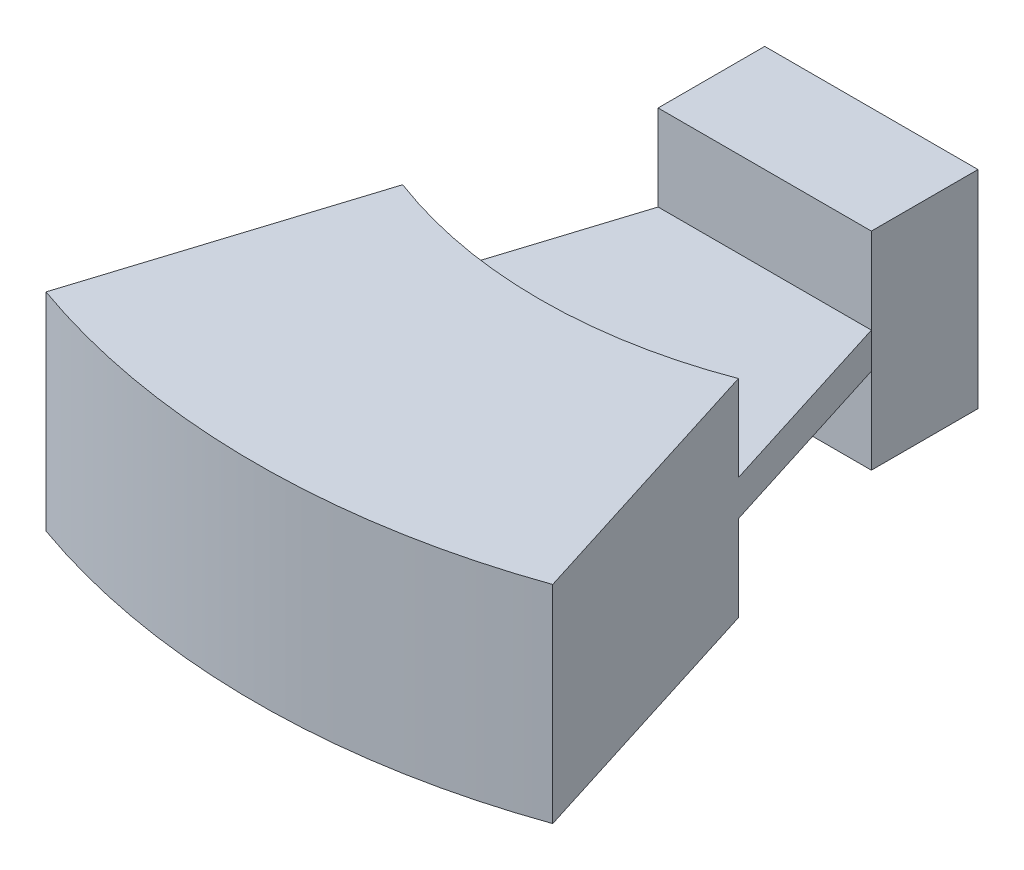
ISO-10303-21;
HEADER;
FILE_DESCRIPTION(('STEP AP214'),'2;1');
FILE_NAME('part.step','',(''),(''),'','','');
FILE_SCHEMA(('AUTOMOTIVE_DESIGN { 1 0 10303 214 1 1 1 1 }'));
ENDSEC;
DATA;
#1=APPLICATION_CONTEXT('core data for automotive mechanical design processes');
#2=APPLICATION_PROTOCOL_DEFINITION('international standard','automotive_design',2000,#1);
#3=PRODUCT_CONTEXT('',#1,'mechanical');
#4=PRODUCT('Part','Part','',(#3));
#5=PRODUCT_RELATED_PRODUCT_CATEGORY('part','',(#4));
#6=PRODUCT_DEFINITION_FORMATION('','',#4);
#7=PRODUCT_DEFINITION_CONTEXT('part definition',#1,'design');
#8=PRODUCT_DEFINITION('design','',#6,#7);
#9=PRODUCT_DEFINITION_SHAPE('','',#8);
#10=(LENGTH_UNIT() NAMED_UNIT(*) SI_UNIT(.MILLI.,.METRE.));
#11=(NAMED_UNIT(*) PLANE_ANGLE_UNIT() SI_UNIT($,.RADIAN.));
#12=(NAMED_UNIT(*) SI_UNIT($,.STERADIAN.) SOLID_ANGLE_UNIT());
#13=UNCERTAINTY_MEASURE_WITH_UNIT(LENGTH_MEASURE(1.E-05),#10,'distance_accuracy_value','');
#14=(GEOMETRIC_REPRESENTATION_CONTEXT(3) GLOBAL_UNCERTAINTY_ASSIGNED_CONTEXT((#13)) GLOBAL_UNIT_ASSIGNED_CONTEXT((#10,
#11,#12)) REPRESENTATION_CONTEXT('',''));
#15=CARTESIAN_POINT('',(0.,0.,0.));
#16=DIRECTION('',(0.,0.,1.));
#17=DIRECTION('',(1.,0.,0.));
#18=AXIS2_PLACEMENT_3D('',#15,#16,#17);
#19=CARTESIAN_POINT('',(0.,3.175,0.));
#20=DIRECTION('',(0.,1.,0.));
#21=DIRECTION('',(0.,0.,1.));
#22=AXIS2_PLACEMENT_3D('',#19,#20,#21);
#23=PLANE('',#22);
#24=DIRECTION('',(-0.30070579950427,0.,0.953716950748228));
#25=VECTOR('',#24,1.);
#26=CARTESIAN_POINT('',(-19.05,3.175,44.45));
#27=LINE('',#26,#25);
#28=CARTESIAN_POINT('',(-19.05,3.175,44.45));
#29=VERTEX_POINT('',#28);
#30=CARTESIAN_POINT('',(-29.987865036696,3.175,79.1404758993356));
#31=VERTEX_POINT('',#30);
#32=EDGE_CURVE('E160',#29,#31,#27,.T.);
#33=ORIENTED_EDGE('',*,*,#32,.T.);
#34=CARTESIAN_POINT('',(0.,3.175,0.));
#35=DIRECTION('',(0.,1.,0.));
#36=DIRECTION('',(0.,0.,1.));
#37=AXIS2_PLACEMENT_3D('',#34,#35,#36);
#38=CIRCLE('',#37,84.6314774480063);
#39=CARTESIAN_POINT('',(29.9878650366959,3.175,79.1404758993356));
#40=VERTEX_POINT('',#39);
#41=EDGE_CURVE('E149',#31,#40,#38,.T.);
#42=ORIENTED_EDGE('',*,*,#41,.T.);
#43=DIRECTION('',(-0.300705799504271,0.,-0.953716950748228));
#44=VECTOR('',#43,1.);
#45=CARTESIAN_POINT('',(37.6257923441044,3.175,103.364886448341));
#46=LINE('',#45,#44);
#47=CARTESIAN_POINT('',(19.05,3.175,44.45));
#48=VERTEX_POINT('',#47);
#49=EDGE_CURVE('E163',#40,#48,#46,.T.);
#50=ORIENTED_EDGE('',*,*,#49,.T.);
#51=DIRECTION('',(-1.,0.,0.));
#52=VECTOR('',#51,1.);
#53=CARTESIAN_POINT('',(-19.05,3.175,44.45));
#54=LINE('',#53,#52);
#55=EDGE_CURVE('E157',#48,#29,#54,.T.);
#56=ORIENTED_EDGE('',*,*,#55,.T.);
#57=EDGE_LOOP('',(#33,#42,#50,#56));
#58=FACE_BOUND('',#57,.T.);
#59=ADVANCED_FACE('F34',(#58),#23,.T.);
#60=CARTESIAN_POINT('',(0.,-3.175,0.));
#61=DIRECTION('',(0.,1.,0.));
#62=DIRECTION('',(0.,0.,1.));
#63=AXIS2_PLACEMENT_3D('',#60,#61,#62);
#64=PLANE('',#63);
#65=CARTESIAN_POINT('',(0.,-3.175,0.));
#66=DIRECTION('',(0.,1.,0.));
#67=DIRECTION('',(0.,0.,1.));
#68=AXIS2_PLACEMENT_3D('',#65,#66,#67);
#69=CIRCLE('',#68,84.6314774480063);
#70=CARTESIAN_POINT('',(-29.987865036696,-3.175,79.1404758993356));
#71=VERTEX_POINT('',#70);
#72=CARTESIAN_POINT('',(29.9878650366959,-3.175,79.1404758993356));
#73=VERTEX_POINT('',#72);
#74=EDGE_CURVE('E11',#71,#73,#69,.T.);
#75=ORIENTED_EDGE('',*,*,#74,.F.);
#76=DIRECTION('',(-0.30070579950427,0.,0.953716950748228));
#77=VECTOR('',#76,1.);
#78=CARTESIAN_POINT('',(-19.05,-3.175,44.45));
#79=LINE('',#78,#77);
#80=CARTESIAN_POINT('',(-19.05,-3.175,44.45));
#81=VERTEX_POINT('',#80);
#82=EDGE_CURVE('E167',#81,#71,#79,.T.);
#83=ORIENTED_EDGE('',*,*,#82,.F.);
#84=DIRECTION('',(-1.,0.,0.));
#85=VECTOR('',#84,1.);
#86=CARTESIAN_POINT('',(-19.05,-3.175,44.45));
#87=LINE('',#86,#85);
#88=CARTESIAN_POINT('',(19.05,-3.175,44.45));
#89=VERTEX_POINT('',#88);
#90=EDGE_CURVE('E49',#89,#81,#87,.T.);
#91=ORIENTED_EDGE('',*,*,#90,.F.);
#92=DIRECTION('',(-0.300705799504271,0.,-0.953716950748228));
#93=VECTOR('',#92,1.);
#94=CARTESIAN_POINT('',(37.6257923441044,-3.175,103.364886448341));
#95=LINE('',#94,#93);
#96=EDGE_CURVE('E57',#73,#89,#95,.T.);
#97=ORIENTED_EDGE('',*,*,#96,.F.);
#98=EDGE_LOOP('',(#75,#83,#91,#97));
#99=FACE_BOUND('',#98,.T.);
#100=ADVANCED_FACE('F230',(#99),#64,.F.);
#101=CARTESIAN_POINT('',(-19.05,18.5,44.45));
#102=DIRECTION('',(0.,0.,-1.));
#103=DIRECTION('',(-1.,0.,0.));
#104=AXIS2_PLACEMENT_3D('',#101,#102,#103);
#105=PLANE('',#104);
#106=ORIENTED_EDGE('',*,*,#55,.F.);
#107=DIRECTION('',(0.,-1.,0.));
#108=VECTOR('',#107,1.);
#109=CARTESIAN_POINT('',(19.05,18.5,44.45));
#110=LINE('',#109,#108);
#111=CARTESIAN_POINT('',(19.05,18.5,44.45));
#112=VERTEX_POINT('',#111);
#113=EDGE_CURVE('E202',#112,#48,#110,.T.);
#114=ORIENTED_EDGE('',*,*,#113,.F.);
#115=DIRECTION('',(1.,0.,0.));
#116=VECTOR('',#115,1.);
#117=CARTESIAN_POINT('',(-19.05,18.5,44.45));
#118=LINE('',#117,#116);
#119=CARTESIAN_POINT('',(-19.05,18.5,44.45));
#120=VERTEX_POINT('',#119);
#121=EDGE_CURVE('E180',#120,#112,#118,.T.);
#122=ORIENTED_EDGE('',*,*,#121,.F.);
#123=DIRECTION('',(0.,-1.,0.));
#124=VECTOR('',#123,1.);
#125=CARTESIAN_POINT('',(-19.05,18.5,44.45));
#126=LINE('',#125,#124);
#127=EDGE_CURVE('E42',#120,#29,#126,.T.);
#128=ORIENTED_EDGE('',*,*,#127,.T.);
#129=EDGE_LOOP('',(#106,#114,#122,#128));
#130=FACE_BOUND('',#129,.T.);
#131=ADVANCED_FACE('F238',(#130),#105,.F.);
#132=CARTESIAN_POINT('',(-19.05,18.5,25.4));
#133=DIRECTION('',(1.,0.,0.));
#134=DIRECTION('',(0.,0.,-1.));
#135=AXIS2_PLACEMENT_3D('',#132,#133,#134);
#136=PLANE('',#135);
#137=DIRECTION('',(0.,0.,1.));
#138=VECTOR('',#137,1.);
#139=CARTESIAN_POINT('',(-19.05,-18.5,25.4));
#140=LINE('',#139,#138);
#141=CARTESIAN_POINT('',(-19.05,-18.5,25.4));
#142=VERTEX_POINT('',#141);
#143=CARTESIAN_POINT('',(-19.05,-18.5,44.45));
#144=VERTEX_POINT('',#143);
#145=EDGE_CURVE('E176',#142,#144,#140,.T.);
#146=ORIENTED_EDGE('',*,*,#145,.T.);
#147=EDGE_CURVE('E204',#81,#144,#126,.T.);
#148=ORIENTED_EDGE('',*,*,#147,.F.);
#149=DIRECTION('',(0.,-1.,0.));
#150=VECTOR('',#149,1.);
#151=CARTESIAN_POINT('',(-19.05,3.175,44.45));
#152=LINE('',#151,#150);
#153=EDGE_CURVE('E173',#29,#81,#152,.T.);
#154=ORIENTED_EDGE('',*,*,#153,.F.);
#155=ORIENTED_EDGE('',*,*,#127,.F.);
#156=DIRECTION('',(0.,0.,1.));
#157=VECTOR('',#156,1.);
#158=CARTESIAN_POINT('',(-19.05,18.5,25.4));
#159=LINE('',#158,#157);
#160=CARTESIAN_POINT('',(-19.05,18.5,25.4));
#161=VERTEX_POINT('',#160);
#162=EDGE_CURVE('E177',#161,#120,#159,.T.);
#163=ORIENTED_EDGE('',*,*,#162,.F.);
#164=DIRECTION('',(0.,-1.,0.));
#165=VECTOR('',#164,1.);
#166=CARTESIAN_POINT('',(-19.05,18.5,25.4));
#167=LINE('',#166,#165);
#168=EDGE_CURVE('E187',#161,#142,#167,.T.);
#169=ORIENTED_EDGE('',*,*,#168,.T.);
#170=EDGE_LOOP('',(#146,#148,#154,#155,#163,#169));
#171=FACE_BOUND('',#170,.T.);
#172=ADVANCED_FACE('F36',(#171),#136,.F.);
#173=CARTESIAN_POINT('',(19.05,-18.5,44.45));
#174=VERTEX_POINT('',#173);
#175=EDGE_CURVE('E201',#89,#174,#110,.T.);
#176=ORIENTED_EDGE('',*,*,#175,.F.);
#177=ORIENTED_EDGE('',*,*,#90,.T.);
#178=ORIENTED_EDGE('',*,*,#147,.T.);
#179=DIRECTION('',(1.,0.,0.));
#180=VECTOR('',#179,1.);
#181=CARTESIAN_POINT('',(-19.05,-18.5,44.45));
#182=LINE('',#181,#180);
#183=EDGE_CURVE('E190',#144,#174,#182,.T.);
#184=ORIENTED_EDGE('',*,*,#183,.T.);
#185=EDGE_LOOP('',(#176,#177,#178,#184));
#186=FACE_BOUND('',#185,.T.);
#187=ADVANCED_FACE('F210',(#186),#105,.F.);
#188=CARTESIAN_POINT('',(19.05,18.5,25.4));
#189=DIRECTION('',(-1.,0.,0.));
#190=DIRECTION('',(0.,0.,1.));
#191=AXIS2_PLACEMENT_3D('',#188,#189,#190);
#192=PLANE('',#191);
#193=DIRECTION('',(0.,0.,-1.));
#194=VECTOR('',#193,1.);
#195=CARTESIAN_POINT('',(19.05,-18.5,25.4));
#196=LINE('',#195,#194);
#197=CARTESIAN_POINT('',(19.05,-18.5,25.4));
#198=VERTEX_POINT('',#197);
#199=EDGE_CURVE('E193',#174,#198,#196,.T.);
#200=ORIENTED_EDGE('',*,*,#199,.T.);
#201=DIRECTION('',(0.,-1.,0.));
#202=VECTOR('',#201,1.);
#203=CARTESIAN_POINT('',(19.05,18.5,25.4));
#204=LINE('',#203,#202);
#205=CARTESIAN_POINT('',(19.05,18.5,25.4));
#206=VERTEX_POINT('',#205);
#207=EDGE_CURVE('E198',#206,#198,#204,.T.);
#208=ORIENTED_EDGE('',*,*,#207,.F.);
#209=DIRECTION('',(0.,0.,-1.));
#210=VECTOR('',#209,1.);
#211=CARTESIAN_POINT('',(19.05,18.5,25.4));
#212=LINE('',#211,#210);
#213=EDGE_CURVE('E183',#112,#206,#212,.T.);
#214=ORIENTED_EDGE('',*,*,#213,.F.);
#215=ORIENTED_EDGE('',*,*,#113,.T.);
#216=DIRECTION('',(0.,-1.,0.));
#217=VECTOR('',#216,1.);
#218=CARTESIAN_POINT('',(19.05,3.175,44.45));
#219=LINE('',#218,#217);
#220=EDGE_CURVE('E165',#48,#89,#219,.T.);
#221=ORIENTED_EDGE('',*,*,#220,.T.);
#222=ORIENTED_EDGE('',*,*,#175,.T.);
#223=EDGE_LOOP('',(#200,#208,#214,#215,#221,#222));
#224=FACE_BOUND('',#223,.T.);
#225=ADVANCED_FACE('F226',(#224),#192,.F.);
#226=CARTESIAN_POINT('',(-19.05,18.5,25.4));
#227=DIRECTION('',(0.,0.,1.));
#228=DIRECTION('',(1.,0.,0.));
#229=AXIS2_PLACEMENT_3D('',#226,#227,#228);
#230=PLANE('',#229);
#231=DIRECTION('',(-1.,0.,0.));
#232=VECTOR('',#231,1.);
#233=CARTESIAN_POINT('',(-19.05,-18.5,25.4));
#234=LINE('',#233,#232);
#235=EDGE_CURVE('E181',#198,#142,#234,.T.);
#236=ORIENTED_EDGE('',*,*,#235,.T.);
#237=ORIENTED_EDGE('',*,*,#168,.F.);
#238=DIRECTION('',(-1.,0.,0.));
#239=VECTOR('',#238,1.);
#240=CARTESIAN_POINT('',(-19.05,18.5,25.4));
#241=LINE('',#240,#239);
#242=EDGE_CURVE('E185',#206,#161,#241,.T.);
#243=ORIENTED_EDGE('',*,*,#242,.F.);
#244=ORIENTED_EDGE('',*,*,#207,.T.);
#245=EDGE_LOOP('',(#236,#237,#243,#244));
#246=FACE_BOUND('',#245,.T.);
#247=ADVANCED_FACE('F222',(#246),#230,.F.);
#248=CARTESIAN_POINT('',(0.,18.5,0.));
#249=DIRECTION('',(0.,1.,0.));
#250=DIRECTION('',(0.,0.,1.));
#251=AXIS2_PLACEMENT_3D('',#248,#249,#250);
#252=PLANE('',#251);
#253=ORIENTED_EDGE('',*,*,#162,.T.);
#254=ORIENTED_EDGE('',*,*,#121,.T.);
#255=ORIENTED_EDGE('',*,*,#213,.T.);
#256=ORIENTED_EDGE('',*,*,#242,.T.);
#257=EDGE_LOOP('',(#253,#254,#255,#256));
#258=FACE_BOUND('',#257,.T.);
#259=ADVANCED_FACE('F240',(#258),#252,.T.);
#260=CARTESIAN_POINT('',(0.,-18.5,0.));
#261=DIRECTION('',(0.,1.,0.));
#262=DIRECTION('',(0.,0.,1.));
#263=AXIS2_PLACEMENT_3D('',#260,#261,#262);
#264=PLANE('',#263);
#265=ORIENTED_EDGE('',*,*,#145,.F.);
#266=ORIENTED_EDGE('',*,*,#235,.F.);
#267=ORIENTED_EDGE('',*,*,#199,.F.);
#268=ORIENTED_EDGE('',*,*,#183,.F.);
#269=EDGE_LOOP('',(#265,#266,#267,#268));
#270=FACE_BOUND('',#269,.T.);
#271=ADVANCED_FACE('F216',(#270),#264,.F.);
#272=CARTESIAN_POINT('',(-19.05,3.175,44.45));
#273=DIRECTION('',(0.953716950748228,0.,0.30070579950427));
#274=DIRECTION('',(0.30070579950427,0.,-0.953716950748228));
#275=AXIS2_PLACEMENT_3D('',#272,#273,#274);
#276=PLANE('',#275);
#277=DIRECTION('',(0.,-1.,0.));
#278=VECTOR('',#277,1.);
#279=CARTESIAN_POINT('',(-29.987865036696,18.5,79.1404758993356));
#280=LINE('',#279,#278);
#281=CARTESIAN_POINT('',(-29.987865036696,18.5,79.1404758993356));
#282=VERTEX_POINT('',#281);
#283=EDGE_CURVE('E236',#282,#31,#280,.T.);
#284=ORIENTED_EDGE('',*,*,#283,.T.);
#285=ORIENTED_EDGE('',*,*,#32,.F.);
#286=ORIENTED_EDGE('',*,*,#153,.T.);
#287=ORIENTED_EDGE('',*,*,#82,.T.);
#288=CARTESIAN_POINT('',(-29.987865036696,-18.5,79.1404758993356));
#289=VERTEX_POINT('',#288);
#290=EDGE_CURVE('E390',#71,#289,#280,.T.);
#291=ORIENTED_EDGE('',*,*,#290,.T.);
#292=DIRECTION('',(-0.30070579950427,0.,0.953716950748228));
#293=VECTOR('',#292,1.);
#294=CARTESIAN_POINT('',(-29.987865036696,-18.5,79.1404758993356));
#295=LINE('',#294,#293);
#296=CARTESIAN_POINT('',(-45.2637196515129,-18.5,127.589296997346));
#297=VERTEX_POINT('',#296);
#298=EDGE_CURVE('E144',#289,#297,#295,.T.);
#299=ORIENTED_EDGE('',*,*,#298,.T.);
#300=DIRECTION('',(0.,-1.,0.));
#301=VECTOR('',#300,1.);
#302=CARTESIAN_POINT('',(-45.2637196515129,18.5,127.589296997346));
#303=LINE('',#302,#301);
#304=CARTESIAN_POINT('',(-45.2637196515129,18.5,127.589296997346));
#305=VERTEX_POINT('',#304);
#306=EDGE_CURVE('E389',#305,#297,#303,.T.);
#307=ORIENTED_EDGE('',*,*,#306,.F.);
#308=DIRECTION('',(-0.30070579950427,0.,0.953716950748228));
#309=VECTOR('',#308,1.);
#310=CARTESIAN_POINT('',(-29.987865036696,18.5,79.1404758993356));
#311=LINE('',#310,#309);
#312=EDGE_CURVE('E140',#282,#305,#311,.T.);
#313=ORIENTED_EDGE('',*,*,#312,.F.);
#314=EDGE_LOOP('',(#284,#285,#286,#287,#291,#299,#307,#313));
#315=FACE_BOUND('',#314,.T.);
#316=ADVANCED_FACE('F234',(#315),#276,.F.);
#317=CARTESIAN_POINT('',(37.6257923441044,3.175,103.364886448341));
#318=DIRECTION('',(-0.953716950748228,0.,0.300705799504271));
#319=DIRECTION('',(0.300705799504271,0.,0.953716950748228));
#320=AXIS2_PLACEMENT_3D('',#317,#318,#319);
#321=PLANE('',#320);
#322=DIRECTION('',(0.,-1.,0.));
#323=VECTOR('',#322,1.);
#324=CARTESIAN_POINT('',(29.9878650366959,18.5,79.1404758993356));
#325=LINE('',#324,#323);
#326=CARTESIAN_POINT('',(29.9878650366959,-18.5,79.1404758993356));
#327=VERTEX_POINT('',#326);
#328=EDGE_CURVE('E153',#73,#327,#325,.T.);
#329=ORIENTED_EDGE('',*,*,#328,.F.);
#330=ORIENTED_EDGE('',*,*,#96,.T.);
#331=ORIENTED_EDGE('',*,*,#220,.F.);
#332=ORIENTED_EDGE('',*,*,#49,.F.);
#333=CARTESIAN_POINT('',(29.9878650366959,18.5,79.1404758993356));
#334=VERTEX_POINT('',#333);
#335=EDGE_CURVE('E131',#334,#40,#325,.T.);
#336=ORIENTED_EDGE('',*,*,#335,.F.);
#337=DIRECTION('',(-0.30070579950427,0.,-0.953716950748228));
#338=VECTOR('',#337,1.);
#339=CARTESIAN_POINT('',(45.2637196515129,18.5,127.589296997346));
#340=LINE('',#339,#338);
#341=CARTESIAN_POINT('',(45.2637196515129,18.5,127.589296997346));
#342=VERTEX_POINT('',#341);
#343=EDGE_CURVE('E123',#342,#334,#340,.T.);
#344=ORIENTED_EDGE('',*,*,#343,.F.);
#345=DIRECTION('',(0.,-1.,0.));
#346=VECTOR('',#345,1.);
#347=CARTESIAN_POINT('',(45.2637196515129,18.5,127.589296997346));
#348=LINE('',#347,#346);
#349=CARTESIAN_POINT('',(45.2637196515129,-18.5,127.589296997346));
#350=VERTEX_POINT('',#349);
#351=EDGE_CURVE('E128',#342,#350,#348,.T.);
#352=ORIENTED_EDGE('',*,*,#351,.T.);
#353=DIRECTION('',(-0.30070579950427,0.,-0.953716950748228));
#354=VECTOR('',#353,1.);
#355=CARTESIAN_POINT('',(45.2637196515129,-18.5,127.589296997346));
#356=LINE('',#355,#354);
#357=EDGE_CURVE('E379',#350,#327,#356,.T.);
#358=ORIENTED_EDGE('',*,*,#357,.T.);
#359=EDGE_LOOP('',(#329,#330,#331,#332,#336,#344,#352,#358));
#360=FACE_BOUND('',#359,.T.);
#361=ADVANCED_FACE('F125',(#360),#321,.F.);
#362=CARTESIAN_POINT('',(0.,18.5,0.));
#363=DIRECTION('',(0.,-1.,0.));
#364=DIRECTION('',(0.,0.,-1.));
#365=AXIS2_PLACEMENT_3D('',#362,#363,#364);
#366=CYLINDRICAL_SURFACE('',#365,84.6314774480063);
#367=ORIENTED_EDGE('',*,*,#290,.F.);
#368=ORIENTED_EDGE('',*,*,#74,.T.);
#369=ORIENTED_EDGE('',*,*,#328,.T.);
#370=CARTESIAN_POINT('',(0.,-18.5,0.));
#371=DIRECTION('',(0.,-1.,0.));
#372=DIRECTION('',(0.,0.,1.));
#373=AXIS2_PLACEMENT_3D('',#370,#371,#372);
#374=CIRCLE('',#373,84.6314774480063);
#375=EDGE_CURVE('E381',#327,#289,#374,.T.);
#376=ORIENTED_EDGE('',*,*,#375,.T.);
#377=EDGE_LOOP('',(#367,#368,#369,#376));
#378=FACE_BOUND('',#377,.T.);
#379=ADVANCED_FACE('F260',(#378),#366,.F.);
#380=CARTESIAN_POINT('',(0.,18.5,0.));
#381=DIRECTION('',(0.,-1.,0.));
#382=DIRECTION('',(0.,0.,-1.));
#383=AXIS2_PLACEMENT_3D('',#380,#381,#382);
#384=CYLINDRICAL_SURFACE('',#383,135.380327318882);
#385=CARTESIAN_POINT('',(0.,-18.5,0.));
#386=DIRECTION('',(0.,1.,0.));
#387=DIRECTION('',(0.,0.,1.));
#388=AXIS2_PLACEMENT_3D('',#385,#386,#387);
#389=CIRCLE('',#388,135.380327318882);
#390=EDGE_CURVE('E148',#297,#350,#389,.T.);
#391=ORIENTED_EDGE('',*,*,#390,.T.);
#392=ORIENTED_EDGE('',*,*,#351,.F.);
#393=CARTESIAN_POINT('',(0.,18.5,0.));
#394=DIRECTION('',(0.,1.,0.));
#395=DIRECTION('',(0.,0.,1.));
#396=AXIS2_PLACEMENT_3D('',#393,#394,#395);
#397=CIRCLE('',#396,135.380327318882);
#398=EDGE_CURVE('E135',#305,#342,#397,.T.);
#399=ORIENTED_EDGE('',*,*,#398,.F.);
#400=ORIENTED_EDGE('',*,*,#306,.T.);
#401=EDGE_LOOP('',(#391,#392,#399,#400));
#402=FACE_BOUND('',#401,.T.);
#403=ADVANCED_FACE('F146',(#402),#384,.T.);
#404=ORIENTED_EDGE('',*,*,#41,.F.);
#405=ORIENTED_EDGE('',*,*,#283,.F.);
#406=CARTESIAN_POINT('',(0.,18.5,0.));
#407=DIRECTION('',(0.,-1.,0.));
#408=DIRECTION('',(0.,0.,1.));
#409=AXIS2_PLACEMENT_3D('',#406,#407,#408);
#410=CIRCLE('',#409,84.6314774480063);
#411=EDGE_CURVE('E134',#334,#282,#410,.T.);
#412=ORIENTED_EDGE('',*,*,#411,.F.);
#413=ORIENTED_EDGE('',*,*,#335,.T.);
#414=EDGE_LOOP('',(#404,#405,#412,#413));
#415=FACE_BOUND('',#414,.T.);
#416=ADVANCED_FACE('F278',(#415),#366,.F.);
#417=CARTESIAN_POINT('',(0.,18.5,0.));
#418=DIRECTION('',(0.,1.,0.));
#419=DIRECTION('',(0.,0.,1.));
#420=AXIS2_PLACEMENT_3D('',#417,#418,#419);
#421=PLANE('',#420);
#422=ORIENTED_EDGE('',*,*,#398,.T.);
#423=ORIENTED_EDGE('',*,*,#343,.T.);
#424=ORIENTED_EDGE('',*,*,#411,.T.);
#425=ORIENTED_EDGE('',*,*,#312,.T.);
#426=EDGE_LOOP('',(#422,#423,#424,#425));
#427=FACE_BOUND('',#426,.T.);
#428=ADVANCED_FACE('F138',(#427),#421,.T.);
#429=CARTESIAN_POINT('',(0.,-18.5,0.));
#430=DIRECTION('',(0.,1.,0.));
#431=DIRECTION('',(0.,0.,1.));
#432=AXIS2_PLACEMENT_3D('',#429,#430,#431);
#433=PLANE('',#432);
#434=ORIENTED_EDGE('',*,*,#390,.F.);
#435=ORIENTED_EDGE('',*,*,#298,.F.);
#436=ORIENTED_EDGE('',*,*,#375,.F.);
#437=ORIENTED_EDGE('',*,*,#357,.F.);
#438=EDGE_LOOP('',(#434,#435,#436,#437));
#439=FACE_BOUND('',#438,.T.);
#440=ADVANCED_FACE('F295',(#439),#433,.F.);
#441=CLOSED_SHELL('',(#59,#100,#131,#172,#187,#225,#247,#259,#271,#316,#361,#379,#403,#416,#428,#440));
#442=MANIFOLD_SOLID_BREP('B2',#441);
#443=ADVANCED_BREP_SHAPE_REPRESENTATION('',(#18,#442),#14);
#444=SHAPE_DEFINITION_REPRESENTATION(#9,#443);
ENDSEC;
END-ISO-10303-21;
